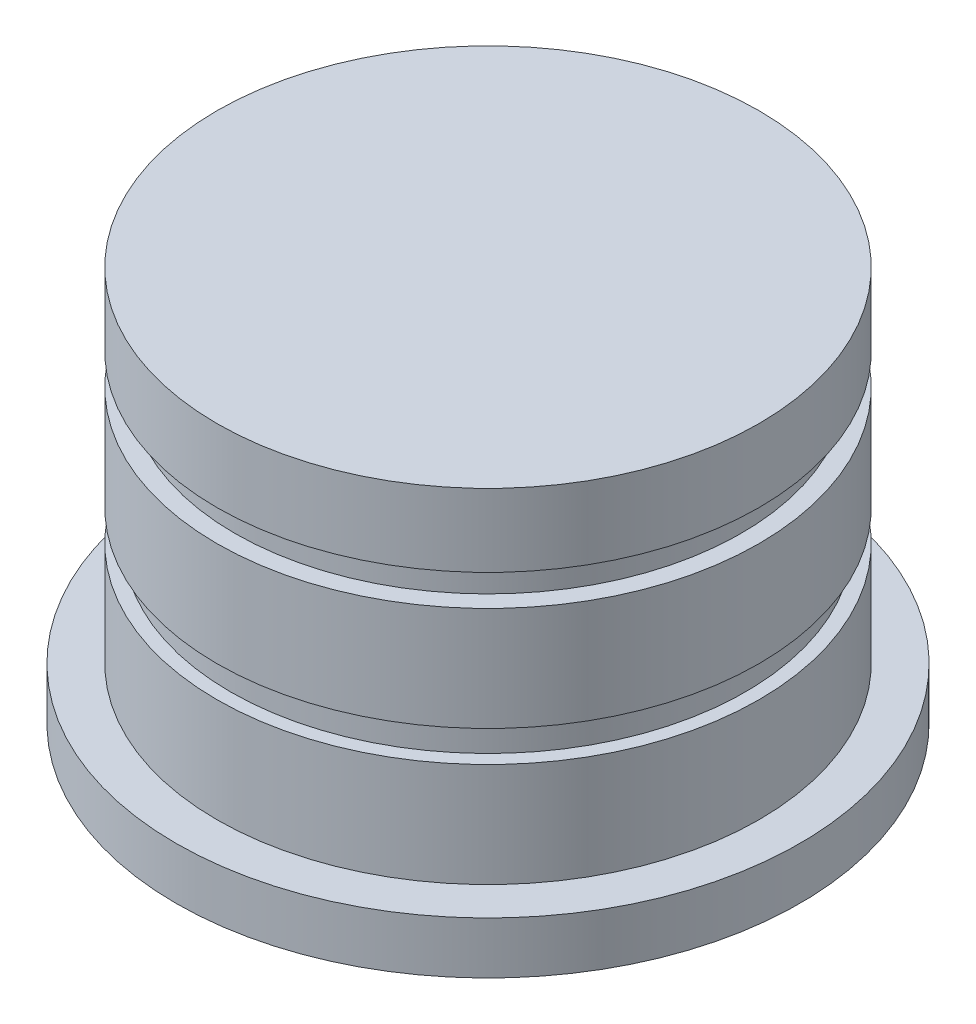
ISO-10303-21;
HEADER;
FILE_DESCRIPTION(('STEP AP214'),'2;1');
FILE_NAME('part.step','',(''),(''),'','','');
FILE_SCHEMA(('AUTOMOTIVE_DESIGN { 1 0 10303 214 1 1 1 1 }'));
ENDSEC;
DATA;
#1=APPLICATION_CONTEXT('core data for automotive mechanical design processes');
#2=APPLICATION_PROTOCOL_DEFINITION('international standard','automotive_design',2000,#1);
#3=PRODUCT_CONTEXT('',#1,'mechanical');
#4=PRODUCT('Part','Part','',(#3));
#5=PRODUCT_RELATED_PRODUCT_CATEGORY('part','',(#4));
#6=PRODUCT_DEFINITION_FORMATION('','',#4);
#7=PRODUCT_DEFINITION_CONTEXT('part definition',#1,'design');
#8=PRODUCT_DEFINITION('design','',#6,#7);
#9=PRODUCT_DEFINITION_SHAPE('','',#8);
#10=(LENGTH_UNIT() NAMED_UNIT(*) SI_UNIT(.MILLI.,.METRE.));
#11=(NAMED_UNIT(*) PLANE_ANGLE_UNIT() SI_UNIT($,.RADIAN.));
#12=(NAMED_UNIT(*) SI_UNIT($,.STERADIAN.) SOLID_ANGLE_UNIT());
#13=UNCERTAINTY_MEASURE_WITH_UNIT(LENGTH_MEASURE(1.E-05),#10,'distance_accuracy_value','');
#14=(GEOMETRIC_REPRESENTATION_CONTEXT(3) GLOBAL_UNCERTAINTY_ASSIGNED_CONTEXT((#13)) GLOBAL_UNIT_ASSIGNED_CONTEXT((#10,
#11,#12)) REPRESENTATION_CONTEXT('',''));
#15=CARTESIAN_POINT('',(0.,0.,0.));
#16=DIRECTION('',(0.,0.,1.));
#17=DIRECTION('',(1.,0.,0.));
#18=AXIS2_PLACEMENT_3D('',#15,#16,#17);
#19=CARTESIAN_POINT('',(0.,1500.,0.));
#20=DIRECTION('',(0.,-1.,0.));
#21=DIRECTION('',(0.,0.,-1.));
#22=AXIS2_PLACEMENT_3D('',#19,#20,#21);
#23=CYLINDRICAL_SURFACE('',#22,2606.51212156869);
#24=CARTESIAN_POINT('',(0.,1500.,0.));
#25=DIRECTION('',(0.,1.,0.));
#26=DIRECTION('',(0.,0.,1.));
#27=AXIS2_PLACEMENT_3D('',#24,#25,#26);
#28=CIRCLE('',#27,2606.51212156869);
#29=CARTESIAN_POINT('',(0.,1500.,2606.51212156869));
#30=VERTEX_POINT('',#29);
#31=EDGE_CURVE('E63',#30,#30,#28,.T.);
#32=ORIENTED_EDGE('',*,*,#31,.F.);
#33=EDGE_LOOP('',(#32));
#34=FACE_BOUND('',#33,.T.);
#35=CARTESIAN_POINT('',(0.,500.,0.));
#36=DIRECTION('',(0.,1.,0.));
#37=DIRECTION('',(0.,0.,1.));
#38=AXIS2_PLACEMENT_3D('',#35,#36,#37);
#39=CIRCLE('',#38,2606.51212156869);
#40=CARTESIAN_POINT('',(0.,500.,2606.51212156869));
#41=VERTEX_POINT('',#40);
#42=EDGE_CURVE('E52',#41,#41,#39,.T.);
#43=ORIENTED_EDGE('',*,*,#42,.T.);
#44=EDGE_LOOP('',(#43));
#45=FACE_BOUND('',#44,.T.);
#46=ADVANCED_FACE('F49',(#34,#45),#23,.T.);
#47=CARTESIAN_POINT('',(0.,1500.,0.));
#48=DIRECTION('',(0.,1.,0.));
#49=DIRECTION('',(0.,0.,1.));
#50=AXIS2_PLACEMENT_3D('',#47,#48,#49);
#51=PLANE('',#50);
#52=CARTESIAN_POINT('',(0.,1500.,0.));
#53=DIRECTION('',(0.,1.,0.));
#54=DIRECTION('',(0.,0.,1.));
#55=AXIS2_PLACEMENT_3D('',#52,#53,#54);
#56=CIRCLE('',#55,2476.56406531322);
#57=CARTESIAN_POINT('',(0.,1500.,2476.56406531322));
#58=VERTEX_POINT('',#57);
#59=EDGE_CURVE('E57',#58,#58,#56,.T.);
#60=ORIENTED_EDGE('',*,*,#59,.F.);
#61=EDGE_LOOP('',(#60));
#62=FACE_BOUND('',#61,.T.);
#63=ORIENTED_EDGE('',*,*,#31,.T.);
#64=EDGE_LOOP('',(#63));
#65=FACE_BOUND('',#64,.T.);
#66=ADVANCED_FACE('F92',(#62,#65),#51,.T.);
#67=CARTESIAN_POINT('',(0.,500.,0.));
#68=DIRECTION('',(0.,1.,0.));
#69=DIRECTION('',(0.,0.,1.));
#70=AXIS2_PLACEMENT_3D('',#67,#68,#69);
#71=PLANE('',#70);
#72=ORIENTED_EDGE('',*,*,#42,.F.);
#73=EDGE_LOOP('',(#72));
#74=FACE_BOUND('',#73,.T.);
#75=ADVANCED_FACE('F89',(#74),#71,.F.);
#76=CARTESIAN_POINT('',(0.,1800.,0.));
#77=DIRECTION('',(0.,-1.,0.));
#78=DIRECTION('',(0.,0.,-1.));
#79=AXIS2_PLACEMENT_3D('',#76,#77,#78);
#80=CYLINDRICAL_SURFACE('',#79,2476.56406531322);
#81=CARTESIAN_POINT('',(0.,1800.,0.));
#82=DIRECTION('',(0.,1.,0.));
#83=DIRECTION('',(0.,0.,1.));
#84=AXIS2_PLACEMENT_3D('',#81,#82,#83);
#85=CIRCLE('',#84,2476.56406531322);
#86=CARTESIAN_POINT('',(0.,1800.,2476.56406531322));
#87=VERTEX_POINT('',#86);
#88=EDGE_CURVE('E73',#87,#87,#85,.T.);
#89=ORIENTED_EDGE('',*,*,#88,.F.);
#90=EDGE_LOOP('',(#89));
#91=FACE_BOUND('',#90,.T.);
#92=ORIENTED_EDGE('',*,*,#59,.T.);
#93=EDGE_LOOP('',(#92));
#94=FACE_BOUND('',#93,.T.);
#95=ADVANCED_FACE('F91',(#91,#94),#80,.T.);
#96=CARTESIAN_POINT('',(0.,2800.,0.));
#97=DIRECTION('',(0.,-1.,0.));
#98=DIRECTION('',(0.,0.,-1.));
#99=AXIS2_PLACEMENT_3D('',#96,#97,#98);
#100=CYLINDRICAL_SURFACE('',#99,2606.51212156869);
#101=CARTESIAN_POINT('',(0.,2800.,0.));
#102=DIRECTION('',(0.,1.,0.));
#103=DIRECTION('',(0.,0.,1.));
#104=AXIS2_PLACEMENT_3D('',#101,#102,#103);
#105=CIRCLE('',#104,2606.51212156869);
#106=CARTESIAN_POINT('',(0.,2800.,2606.51212156869));
#107=VERTEX_POINT('',#106);
#108=EDGE_CURVE('E69',#107,#107,#105,.T.);
#109=ORIENTED_EDGE('',*,*,#108,.F.);
#110=EDGE_LOOP('',(#109));
#111=FACE_BOUND('',#110,.T.);
#112=CARTESIAN_POINT('',(0.,1800.,0.));
#113=DIRECTION('',(0.,1.,0.));
#114=DIRECTION('',(0.,0.,1.));
#115=AXIS2_PLACEMENT_3D('',#112,#113,#114);
#116=CIRCLE('',#115,2606.51212156869);
#117=CARTESIAN_POINT('',(0.,1800.,2606.51212156869));
#118=VERTEX_POINT('',#117);
#119=EDGE_CURVE('E74',#118,#118,#116,.T.);
#120=ORIENTED_EDGE('',*,*,#119,.T.);
#121=EDGE_LOOP('',(#120));
#122=FACE_BOUND('',#121,.T.);
#123=ADVANCED_FACE('F97',(#111,#122),#100,.T.);
#124=CARTESIAN_POINT('',(0.,2800.,0.));
#125=DIRECTION('',(0.,1.,0.));
#126=DIRECTION('',(0.,0.,1.));
#127=AXIS2_PLACEMENT_3D('',#124,#125,#126);
#128=PLANE('',#127);
#129=CARTESIAN_POINT('',(0.,2800.,0.));
#130=DIRECTION('',(0.,1.,0.));
#131=DIRECTION('',(0.,0.,1.));
#132=AXIS2_PLACEMENT_3D('',#129,#130,#131);
#133=CIRCLE('',#132,2435.42771284284);
#134=CARTESIAN_POINT('',(0.,2800.,2435.42771284284));
#135=VERTEX_POINT('',#134);
#136=EDGE_CURVE('E11',#135,#135,#133,.T.);
#137=ORIENTED_EDGE('',*,*,#136,.F.);
#138=EDGE_LOOP('',(#137));
#139=FACE_BOUND('',#138,.T.);
#140=ORIENTED_EDGE('',*,*,#108,.T.);
#141=EDGE_LOOP('',(#140));
#142=FACE_BOUND('',#141,.T.);
#143=ADVANCED_FACE('F129',(#139,#142),#128,.T.);
#144=CARTESIAN_POINT('',(0.,1800.,0.));
#145=DIRECTION('',(0.,1.,0.));
#146=DIRECTION('',(0.,0.,1.));
#147=AXIS2_PLACEMENT_3D('',#144,#145,#146);
#148=PLANE('',#147);
#149=ORIENTED_EDGE('',*,*,#88,.T.);
#150=EDGE_LOOP('',(#149));
#151=FACE_BOUND('',#150,.T.);
#152=ORIENTED_EDGE('',*,*,#119,.F.);
#153=EDGE_LOOP('',(#152));
#154=FACE_BOUND('',#153,.T.);
#155=ADVANCED_FACE('F138',(#151,#154),#148,.F.);
#156=CARTESIAN_POINT('',(0.,3100.,0.));
#157=DIRECTION('',(0.,-1.,0.));
#158=DIRECTION('',(0.,0.,-1.));
#159=AXIS2_PLACEMENT_3D('',#156,#157,#158);
#160=CYLINDRICAL_SURFACE('',#159,2435.42771284284);
#161=CARTESIAN_POINT('',(0.,3100.,0.));
#162=DIRECTION('',(0.,1.,0.));
#163=DIRECTION('',(0.,0.,1.));
#164=AXIS2_PLACEMENT_3D('',#161,#162,#163);
#165=CIRCLE('',#164,2435.42771284284);
#166=CARTESIAN_POINT('',(0.,3100.,2435.42771284284));
#167=VERTEX_POINT('',#166);
#168=EDGE_CURVE('E67',#167,#167,#165,.T.);
#169=ORIENTED_EDGE('',*,*,#168,.F.);
#170=EDGE_LOOP('',(#169));
#171=FACE_BOUND('',#170,.T.);
#172=ORIENTED_EDGE('',*,*,#136,.T.);
#173=EDGE_LOOP('',(#172));
#174=FACE_BOUND('',#173,.T.);
#175=ADVANCED_FACE('F143',(#171,#174),#160,.T.);
#176=CARTESIAN_POINT('',(0.,3800.,0.));
#177=DIRECTION('',(0.,-1.,0.));
#178=DIRECTION('',(0.,0.,-1.));
#179=AXIS2_PLACEMENT_3D('',#176,#177,#178);
#180=CYLINDRICAL_SURFACE('',#179,2606.51212156869);
#181=CARTESIAN_POINT('',(0.,3800.,0.));
#182=DIRECTION('',(0.,1.,0.));
#183=DIRECTION('',(0.,0.,1.));
#184=AXIS2_PLACEMENT_3D('',#181,#182,#183);
#185=CIRCLE('',#184,2606.51212156869);
#186=CARTESIAN_POINT('',(0.,3800.,2606.51212156869));
#187=VERTEX_POINT('',#186);
#188=EDGE_CURVE('E225',#187,#187,#185,.T.);
#189=ORIENTED_EDGE('',*,*,#188,.F.);
#190=EDGE_LOOP('',(#189));
#191=FACE_BOUND('',#190,.T.);
#192=CARTESIAN_POINT('',(0.,3100.,0.));
#193=DIRECTION('',(0.,1.,0.));
#194=DIRECTION('',(0.,0.,1.));
#195=AXIS2_PLACEMENT_3D('',#192,#193,#194);
#196=CIRCLE('',#195,2606.51212156869);
#197=CARTESIAN_POINT('',(0.,3100.,2606.51212156869));
#198=VERTEX_POINT('',#197);
#199=EDGE_CURVE('E222',#198,#198,#196,.T.);
#200=ORIENTED_EDGE('',*,*,#199,.T.);
#201=EDGE_LOOP('',(#200));
#202=FACE_BOUND('',#201,.T.);
#203=ADVANCED_FACE('F162',(#191,#202),#180,.T.);
#204=CARTESIAN_POINT('',(0.,3800.,0.));
#205=DIRECTION('',(0.,1.,0.));
#206=DIRECTION('',(0.,0.,1.));
#207=AXIS2_PLACEMENT_3D('',#204,#205,#206);
#208=PLANE('',#207);
#209=ORIENTED_EDGE('',*,*,#188,.T.);
#210=EDGE_LOOP('',(#209));
#211=FACE_BOUND('',#210,.T.);
#212=ADVANCED_FACE('F173',(#211),#208,.T.);
#213=CARTESIAN_POINT('',(0.,3100.,0.));
#214=DIRECTION('',(0.,1.,0.));
#215=DIRECTION('',(0.,0.,1.));
#216=AXIS2_PLACEMENT_3D('',#213,#214,#215);
#217=PLANE('',#216);
#218=ORIENTED_EDGE('',*,*,#168,.T.);
#219=EDGE_LOOP('',(#218));
#220=FACE_BOUND('',#219,.T.);
#221=ORIENTED_EDGE('',*,*,#199,.F.);
#222=EDGE_LOOP('',(#221));
#223=FACE_BOUND('',#222,.T.);
#224=ADVANCED_FACE('F184',(#220,#223),#217,.F.);
#225=CLOSED_SHELL('',(#46,#66,#75,#95,#123,#143,#155,#175,#203,#212,#224));
#226=MANIFOLD_SOLID_BREP('B2',#225);
#227=CARTESIAN_POINT('',(0.,500.,0.));
#228=DIRECTION('',(0.,-1.,0.));
#229=DIRECTION('',(0.,0.,-1.));
#230=AXIS2_PLACEMENT_3D('',#227,#228,#229);
#231=CYLINDRICAL_SURFACE('',#230,3000.);
#232=CARTESIAN_POINT('',(0.,500.,0.));
#233=DIRECTION('',(0.,1.,0.));
#234=DIRECTION('',(0.,0.,1.));
#235=AXIS2_PLACEMENT_3D('',#232,#233,#234);
#236=CIRCLE('',#235,3000.);
#237=CARTESIAN_POINT('',(0.,500.,3000.));
#238=VERTEX_POINT('',#237);
#239=EDGE_CURVE('E48',#238,#238,#236,.T.);
#240=ORIENTED_EDGE('',*,*,#239,.F.);
#241=EDGE_LOOP('',(#240));
#242=FACE_BOUND('',#241,.T.);
#243=CARTESIAN_POINT('',(0.,0.,0.));
#244=DIRECTION('',(0.,1.,0.));
#245=DIRECTION('',(0.,0.,1.));
#246=AXIS2_PLACEMENT_3D('',#243,#244,#245);
#247=CIRCLE('',#246,3000.);
#248=CARTESIAN_POINT('',(0.,0.,3000.));
#249=VERTEX_POINT('',#248);
#250=EDGE_CURVE('E245',#249,#249,#247,.T.);
#251=ORIENTED_EDGE('',*,*,#250,.T.);
#252=EDGE_LOOP('',(#251));
#253=FACE_BOUND('',#252,.T.);
#254=ADVANCED_FACE('F242',(#242,#253),#231,.T.);
#255=CARTESIAN_POINT('',(0.,500.,0.));
#256=DIRECTION('',(0.,1.,0.));
#257=DIRECTION('',(0.,0.,1.));
#258=AXIS2_PLACEMENT_3D('',#255,#256,#257);
#259=PLANE('',#258);
#260=ORIENTED_EDGE('',*,*,#239,.T.);
#261=EDGE_LOOP('',(#260));
#262=FACE_BOUND('',#261,.T.);
#263=ADVANCED_FACE('F257',(#262),#259,.T.);
#264=CARTESIAN_POINT('',(0.,0.,0.));
#265=DIRECTION('',(0.,1.,0.));
#266=DIRECTION('',(0.,0.,1.));
#267=AXIS2_PLACEMENT_3D('',#264,#265,#266);
#268=PLANE('',#267);
#269=ORIENTED_EDGE('',*,*,#250,.F.);
#270=EDGE_LOOP('',(#269));
#271=FACE_BOUND('',#270,.T.);
#272=ADVANCED_FACE('F255',(#271),#268,.F.);
#273=CLOSED_SHELL('',(#254,#263,#272));
#274=MANIFOLD_SOLID_BREP('B6',#273);
#275=ADVANCED_BREP_SHAPE_REPRESENTATION('',(#18,#226,#274),#14);
#276=SHAPE_DEFINITION_REPRESENTATION(#9,#275);
ENDSEC;
END-ISO-10303-21;
